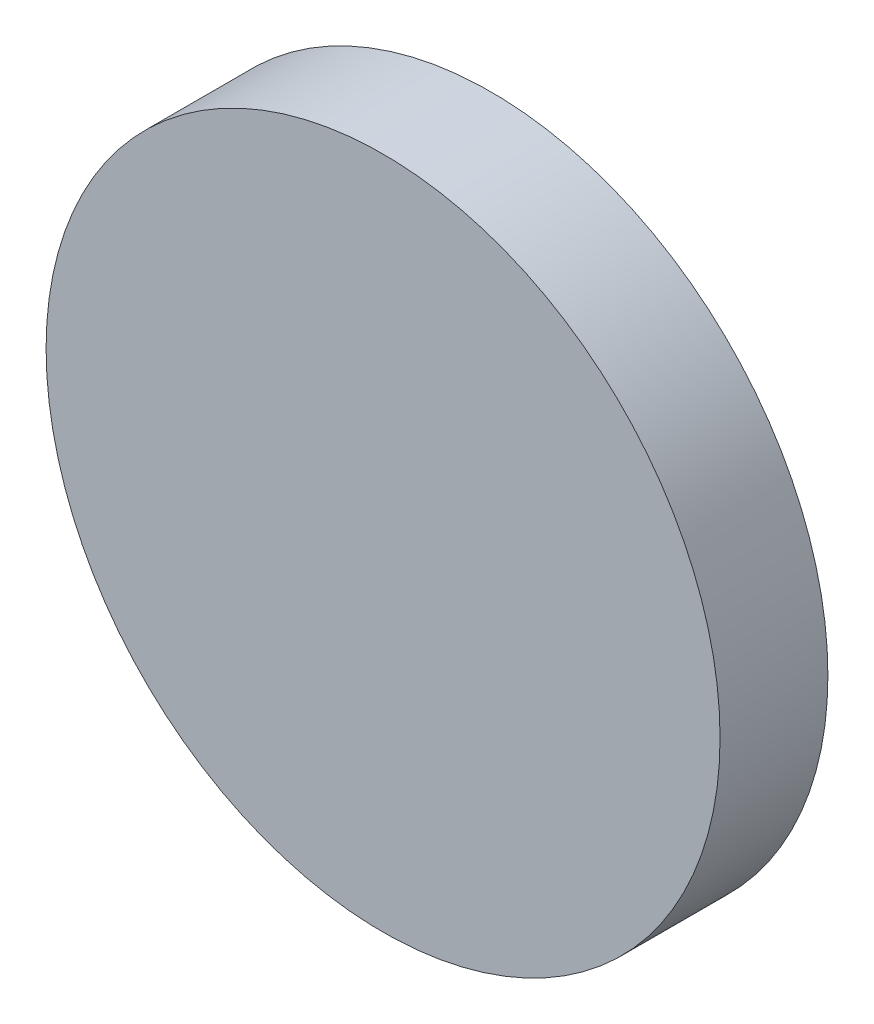
ISO-10303-21;
HEADER;
FILE_DESCRIPTION(('STEP AP214'),'2;1');
FILE_NAME('part.step','',(''),(''),'','','');
FILE_SCHEMA(('AUTOMOTIVE_DESIGN { 1 0 10303 214 1 1 1 1 }'));
ENDSEC;
DATA;
#1=APPLICATION_CONTEXT('core data for automotive mechanical design processes');
#2=APPLICATION_PROTOCOL_DEFINITION('international standard','automotive_design',2000,#1);
#3=PRODUCT_CONTEXT('',#1,'mechanical');
#4=PRODUCT('Part','Part','',(#3));
#5=PRODUCT_RELATED_PRODUCT_CATEGORY('part','',(#4));
#6=PRODUCT_DEFINITION_FORMATION('','',#4);
#7=PRODUCT_DEFINITION_CONTEXT('part definition',#1,'design');
#8=PRODUCT_DEFINITION('design','',#6,#7);
#9=PRODUCT_DEFINITION_SHAPE('','',#8);
#10=(LENGTH_UNIT() NAMED_UNIT(*) SI_UNIT(.MILLI.,.METRE.));
#11=(NAMED_UNIT(*) PLANE_ANGLE_UNIT() SI_UNIT($,.RADIAN.));
#12=(NAMED_UNIT(*) SI_UNIT($,.STERADIAN.) SOLID_ANGLE_UNIT());
#13=UNCERTAINTY_MEASURE_WITH_UNIT(LENGTH_MEASURE(1.E-05),#10,'distance_accuracy_value','');
#14=(GEOMETRIC_REPRESENTATION_CONTEXT(3) GLOBAL_UNCERTAINTY_ASSIGNED_CONTEXT((#13)) GLOBAL_UNIT_ASSIGNED_CONTEXT((#10,
#11,#12)) REPRESENTATION_CONTEXT('',''));
#15=CARTESIAN_POINT('',(0.,0.,0.));
#16=DIRECTION('',(0.,0.,1.));
#17=DIRECTION('',(1.,0.,0.));
#18=AXIS2_PLACEMENT_3D('',#15,#16,#17);
#19=CARTESIAN_POINT('',(0.,0.,2.));
#20=DIRECTION('',(0.,0.,-1.));
#21=DIRECTION('',(-1.,0.,0.));
#22=AXIS2_PLACEMENT_3D('',#19,#20,#21);
#23=CYLINDRICAL_SURFACE('',#22,6.25);
#24=CARTESIAN_POINT('',(0.,0.,2.));
#25=DIRECTION('',(0.,0.,1.));
#26=DIRECTION('',(1.,0.,0.));
#27=AXIS2_PLACEMENT_3D('',#24,#25,#26);
#28=CIRCLE('',#27,6.25);
#29=CARTESIAN_POINT('',(6.25,0.,2.));
#30=VERTEX_POINT('',#29);
#31=EDGE_CURVE('E10',#30,#30,#28,.T.);
#32=ORIENTED_EDGE('',*,*,#31,.F.);
#33=EDGE_LOOP('',(#32));
#34=FACE_BOUND('',#33,.T.);
#35=CARTESIAN_POINT('',(0.,0.,0.));
#36=DIRECTION('',(0.,0.,1.));
#37=DIRECTION('',(1.,0.,0.));
#38=AXIS2_PLACEMENT_3D('',#35,#36,#37);
#39=CIRCLE('',#38,6.25);
#40=CARTESIAN_POINT('',(6.25,0.,0.));
#41=VERTEX_POINT('',#40);
#42=EDGE_CURVE('E38',#41,#41,#39,.T.);
#43=ORIENTED_EDGE('',*,*,#42,.T.);
#44=EDGE_LOOP('',(#43));
#45=FACE_BOUND('',#44,.T.);
#46=ADVANCED_FACE('F35',(#34,#45),#23,.T.);
#47=CARTESIAN_POINT('',(0.,0.,2.));
#48=DIRECTION('',(0.,0.,1.));
#49=DIRECTION('',(1.,0.,0.));
#50=AXIS2_PLACEMENT_3D('',#47,#48,#49);
#51=PLANE('',#50);
#52=ORIENTED_EDGE('',*,*,#31,.T.);
#53=EDGE_LOOP('',(#52));
#54=FACE_BOUND('',#53,.T.);
#55=ADVANCED_FACE('F50',(#54),#51,.T.);
#56=CARTESIAN_POINT('',(0.,0.,0.));
#57=DIRECTION('',(0.,0.,1.));
#58=DIRECTION('',(1.,0.,0.));
#59=AXIS2_PLACEMENT_3D('',#56,#57,#58);
#60=PLANE('',#59);
#61=ORIENTED_EDGE('',*,*,#42,.F.);
#62=EDGE_LOOP('',(#61));
#63=FACE_BOUND('',#62,.T.);
#64=ADVANCED_FACE('F48',(#63),#60,.F.);
#65=CLOSED_SHELL('',(#46,#55,#64));
#66=MANIFOLD_SOLID_BREP('B2',#65);
#67=ADVANCED_BREP_SHAPE_REPRESENTATION('',(#18,#66),#14);
#68=SHAPE_DEFINITION_REPRESENTATION(#9,#67);
ENDSEC;
END-ISO-10303-21;
